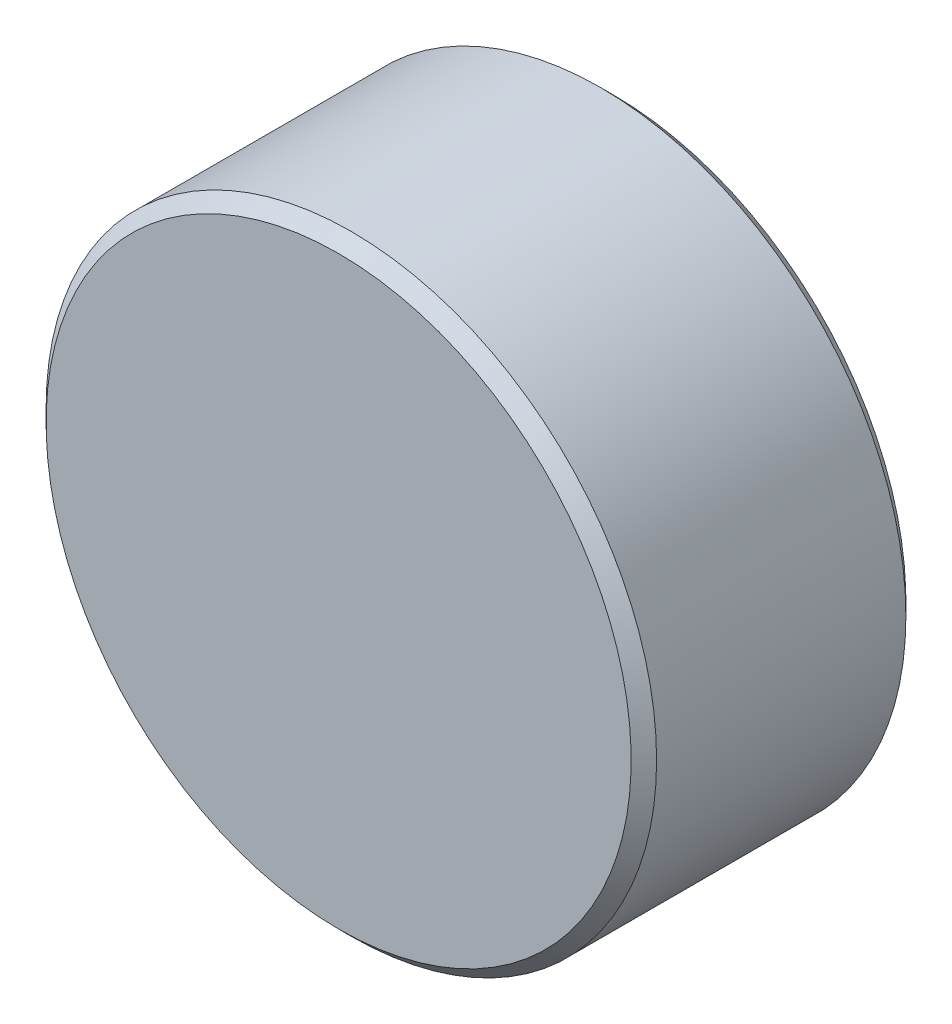
ISO-10303-21;
HEADER;
FILE_DESCRIPTION(('STEP AP214'),'2;1');
FILE_NAME('part.step','',(''),(''),'','','');
FILE_SCHEMA(('AUTOMOTIVE_DESIGN { 1 0 10303 214 1 1 1 1 }'));
ENDSEC;
DATA;
#1=APPLICATION_CONTEXT('core data for automotive mechanical design processes');
#2=APPLICATION_PROTOCOL_DEFINITION('international standard','automotive_design',2000,#1);
#3=PRODUCT_CONTEXT('',#1,'mechanical');
#4=PRODUCT('Part','Part','',(#3));
#5=PRODUCT_RELATED_PRODUCT_CATEGORY('part','',(#4));
#6=PRODUCT_DEFINITION_FORMATION('','',#4);
#7=PRODUCT_DEFINITION_CONTEXT('part definition',#1,'design');
#8=PRODUCT_DEFINITION('design','',#6,#7);
#9=PRODUCT_DEFINITION_SHAPE('','',#8);
#10=(LENGTH_UNIT() NAMED_UNIT(*) SI_UNIT(.MILLI.,.METRE.));
#11=(NAMED_UNIT(*) PLANE_ANGLE_UNIT() SI_UNIT($,.RADIAN.));
#12=(NAMED_UNIT(*) SI_UNIT($,.STERADIAN.) SOLID_ANGLE_UNIT());
#13=UNCERTAINTY_MEASURE_WITH_UNIT(LENGTH_MEASURE(1.E-05),#10,'distance_accuracy_value','');
#14=(GEOMETRIC_REPRESENTATION_CONTEXT(3) GLOBAL_UNCERTAINTY_ASSIGNED_CONTEXT((#13)) GLOBAL_UNIT_ASSIGNED_CONTEXT((#10,
#11,#12)) REPRESENTATION_CONTEXT('',''));
#15=CARTESIAN_POINT('',(0.,0.,0.));
#16=DIRECTION('',(0.,0.,1.));
#17=DIRECTION('',(1.,0.,0.));
#18=AXIS2_PLACEMENT_3D('',#15,#16,#17);
#19=CARTESIAN_POINT('',(0.,0.,14.2875));
#20=DIRECTION('',(0.,0.,1.));
#21=DIRECTION('',(0.,-1.,0.));
#22=AXIS2_PLACEMENT_3D('',#19,#20,#21);
#23=PLANE('',#22);
#24=CARTESIAN_POINT('',(0.,0.,14.2875));
#25=DIRECTION('',(0.,0.,-1.));
#26=DIRECTION('',(0.,1.,0.));
#27=AXIS2_PLACEMENT_3D('',#24,#25,#26);
#28=CIRCLE('',#27,30.4270833333333);
#29=CARTESIAN_POINT('',(0.,30.4270833333333,14.2875));
#30=VERTEX_POINT('',#29);
#31=EDGE_CURVE('E10',#30,#30,#28,.T.);
#32=ORIENTED_EDGE('',*,*,#31,.F.);
#33=EDGE_LOOP('',(#32));
#34=FACE_BOUND('',#33,.T.);
#35=ADVANCED_FACE('F35',(#34),#23,.T.);
#36=CARTESIAN_POINT('',(0.,0.,12.9645833333333));
#37=DIRECTION('',(0.,0.,-1.));
#38=DIRECTION('',(0.,1.,0.));
#39=AXIS2_PLACEMENT_3D('',#36,#37,#38);
#40=CONICAL_SURFACE('',#39,31.75,0.785398163397445);
#41=ORIENTED_EDGE('',*,*,#31,.T.);
#42=EDGE_LOOP('',(#41));
#43=FACE_BOUND('',#42,.T.);
#44=CARTESIAN_POINT('',(0.,0.,12.9645833333333));
#45=DIRECTION('',(0.,0.,-1.));
#46=DIRECTION('',(0.,1.,0.));
#47=AXIS2_PLACEMENT_3D('',#44,#45,#46);
#48=CIRCLE('',#47,31.75);
#49=CARTESIAN_POINT('',(0.,31.75,12.9645833333333));
#50=VERTEX_POINT('',#49);
#51=EDGE_CURVE('E41',#50,#50,#48,.T.);
#52=ORIENTED_EDGE('',*,*,#51,.F.);
#53=EDGE_LOOP('',(#52));
#54=FACE_BOUND('',#53,.T.);
#55=ADVANCED_FACE('F80',(#43,#54),#40,.T.);
#56=CARTESIAN_POINT('',(0.,0.,-14.2875));
#57=DIRECTION('',(0.,0.,-1.));
#58=DIRECTION('',(0.,1.,0.));
#59=AXIS2_PLACEMENT_3D('',#56,#57,#58);
#60=CYLINDRICAL_SURFACE('',#59,31.75);
#61=ORIENTED_EDGE('',*,*,#51,.T.);
#62=EDGE_LOOP('',(#61));
#63=FACE_BOUND('',#62,.T.);
#64=CARTESIAN_POINT('',(0.,0.,-12.9645833333333));
#65=DIRECTION('',(0.,0.,-1.));
#66=DIRECTION('',(0.,1.,0.));
#67=AXIS2_PLACEMENT_3D('',#64,#65,#66);
#68=CIRCLE('',#67,31.75);
#69=CARTESIAN_POINT('',(0.,31.75,-12.9645833333333));
#70=VERTEX_POINT('',#69);
#71=EDGE_CURVE('E45',#70,#70,#68,.T.);
#72=ORIENTED_EDGE('',*,*,#71,.F.);
#73=EDGE_LOOP('',(#72));
#74=FACE_BOUND('',#73,.T.);
#75=ADVANCED_FACE('F85',(#63,#74),#60,.T.);
#76=CARTESIAN_POINT('',(0.,0.,-14.2875));
#77=DIRECTION('',(0.,0.,1.));
#78=DIRECTION('',(0.,-1.,0.));
#79=AXIS2_PLACEMENT_3D('',#76,#77,#78);
#80=CONICAL_SURFACE('',#79,30.4270833333333,0.785398163397454);
#81=ORIENTED_EDGE('',*,*,#71,.T.);
#82=EDGE_LOOP('',(#81));
#83=FACE_BOUND('',#82,.T.);
#84=CARTESIAN_POINT('',(0.,0.,-14.2875));
#85=DIRECTION('',(0.,0.,-1.));
#86=DIRECTION('',(0.,1.,0.));
#87=AXIS2_PLACEMENT_3D('',#84,#85,#86);
#88=CIRCLE('',#87,30.4270833333333);
#89=CARTESIAN_POINT('',(0.,30.4270833333333,-14.2875));
#90=VERTEX_POINT('',#89);
#91=EDGE_CURVE('E49',#90,#90,#88,.T.);
#92=ORIENTED_EDGE('',*,*,#91,.F.);
#93=EDGE_LOOP('',(#92));
#94=FACE_BOUND('',#93,.T.);
#95=ADVANCED_FACE('F89',(#83,#94),#80,.T.);
#96=CARTESIAN_POINT('',(0.,30.4270833333333,-14.2875));
#97=DIRECTION('',(0.,0.,-1.));
#98=DIRECTION('',(0.,1.,0.));
#99=AXIS2_PLACEMENT_3D('',#96,#97,#98);
#100=PLANE('',#99);
#101=ORIENTED_EDGE('',*,*,#91,.T.);
#102=EDGE_LOOP('',(#101));
#103=FACE_BOUND('',#102,.T.);
#104=CARTESIAN_POINT('',(0.,0.,-14.2875));
#105=DIRECTION('',(0.,0.,-1.));
#106=DIRECTION('',(0.,1.,0.));
#107=AXIS2_PLACEMENT_3D('',#104,#105,#106);
#108=CIRCLE('',#107,25.7323166666667);
#109=CARTESIAN_POINT('',(0.,25.7323166666667,-14.2875));
#110=VERTEX_POINT('',#109);
#111=EDGE_CURVE('E54',#110,#110,#108,.T.);
#112=ORIENTED_EDGE('',*,*,#111,.F.);
#113=EDGE_LOOP('',(#112));
#114=FACE_BOUND('',#113,.T.);
#115=ADVANCED_FACE('F76',(#103,#114),#100,.T.);
#116=CARTESIAN_POINT('',(0.,0.,-12.9645833333333));
#117=DIRECTION('',(0.,0.,-1.));
#118=DIRECTION('',(0.,1.,0.));
#119=AXIS2_PLACEMENT_3D('',#116,#117,#118);
#120=CONICAL_SURFACE('',#119,24.4094,0.785398163397445);
#121=ORIENTED_EDGE('',*,*,#111,.T.);
#122=EDGE_LOOP('',(#121));
#123=FACE_BOUND('',#122,.T.);
#124=CARTESIAN_POINT('',(0.,0.,-12.9645833333333));
#125=DIRECTION('',(0.,0.,-1.));
#126=DIRECTION('',(0.,1.,0.));
#127=AXIS2_PLACEMENT_3D('',#124,#125,#126);
#128=CIRCLE('',#127,24.4094);
#129=CARTESIAN_POINT('',(0.,24.4094,-12.9645833333333));
#130=VERTEX_POINT('',#129);
#131=EDGE_CURVE('E57',#130,#130,#128,.T.);
#132=ORIENTED_EDGE('',*,*,#131,.F.);
#133=EDGE_LOOP('',(#132));
#134=FACE_BOUND('',#133,.T.);
#135=ADVANCED_FACE('F68',(#123,#134),#120,.F.);
#136=CARTESIAN_POINT('',(0.,0.,-14.2875));
#137=DIRECTION('',(0.,0.,-1.));
#138=DIRECTION('',(0.,1.,0.));
#139=AXIS2_PLACEMENT_3D('',#136,#137,#138);
#140=CYLINDRICAL_SURFACE('',#139,24.4094);
#141=ORIENTED_EDGE('',*,*,#131,.T.);
#142=EDGE_LOOP('',(#141));
#143=FACE_BOUND('',#142,.T.);
#144=CARTESIAN_POINT('',(0.,0.,-0.800100000000003));
#145=DIRECTION('',(0.,0.,-1.));
#146=DIRECTION('',(0.,1.,0.));
#147=AXIS2_PLACEMENT_3D('',#144,#145,#146);
#148=CIRCLE('',#147,24.4094);
#149=CARTESIAN_POINT('',(0.,24.4094,-0.800099999999996));
#150=VERTEX_POINT('',#149);
#151=EDGE_CURVE('E60',#150,#150,#148,.T.);
#152=ORIENTED_EDGE('',*,*,#151,.F.);
#153=EDGE_LOOP('',(#152));
#154=FACE_BOUND('',#153,.T.);
#155=ADVANCED_FACE('F66',(#143,#154),#140,.F.);
#156=CARTESIAN_POINT('',(0.,24.4094,-0.800099999999994));
#157=DIRECTION('',(0.,0.,-1.));
#158=DIRECTION('',(0.,1.,0.));
#159=AXIS2_PLACEMENT_3D('',#156,#157,#158);
#160=PLANE('',#159);
#161=ORIENTED_EDGE('',*,*,#151,.T.);
#162=EDGE_LOOP('',(#161));
#163=FACE_BOUND('',#162,.T.);
#164=ADVANCED_FACE('F64',(#163),#160,.T.);
#165=CLOSED_SHELL('',(#35,#55,#75,#95,#115,#135,#155,#164));
#166=MANIFOLD_SOLID_BREP('B2',#165);
#167=ADVANCED_BREP_SHAPE_REPRESENTATION('',(#18,#166),#14);
#168=SHAPE_DEFINITION_REPRESENTATION(#9,#167);
ENDSEC;
END-ISO-10303-21;
